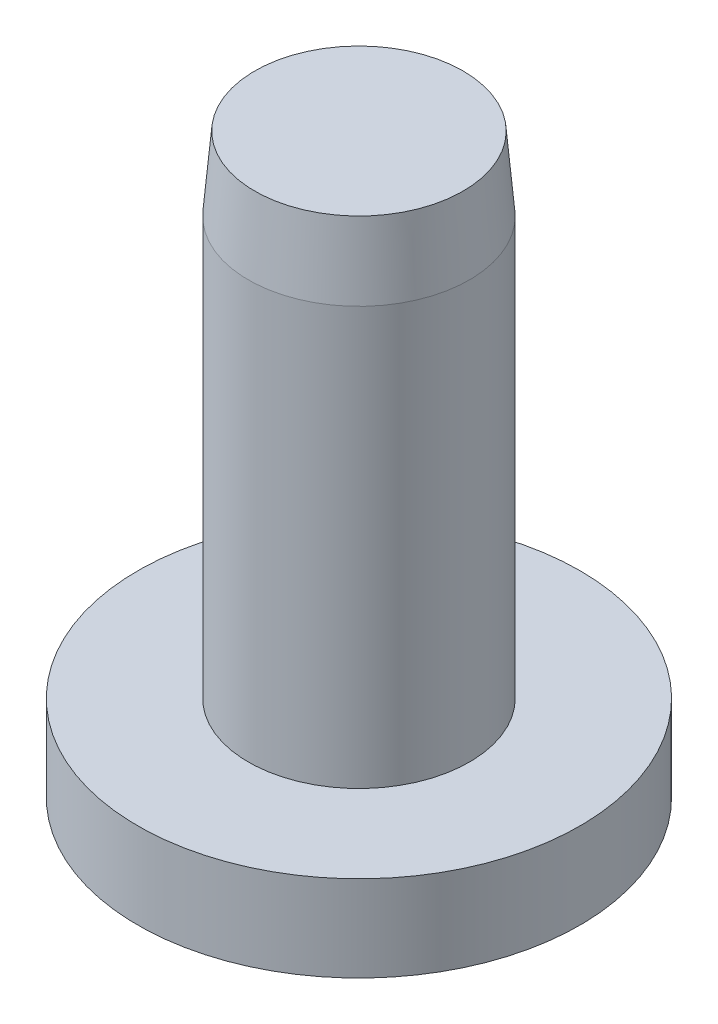
ISO-10303-21;
HEADER;
FILE_DESCRIPTION(('STEP AP214'),'2;1');
FILE_NAME('part.step','',(''),(''),'','','');
FILE_SCHEMA(('AUTOMOTIVE_DESIGN { 1 0 10303 214 1 1 1 1 }'));
ENDSEC;
DATA;
#1=APPLICATION_CONTEXT('core data for automotive mechanical design processes');
#2=APPLICATION_PROTOCOL_DEFINITION('international standard','automotive_design',2000,#1);
#3=PRODUCT_CONTEXT('',#1,'mechanical');
#4=PRODUCT('Part','Part','',(#3));
#5=PRODUCT_RELATED_PRODUCT_CATEGORY('part','',(#4));
#6=PRODUCT_DEFINITION_FORMATION('','',#4);
#7=PRODUCT_DEFINITION_CONTEXT('part definition',#1,'design');
#8=PRODUCT_DEFINITION('design','',#6,#7);
#9=PRODUCT_DEFINITION_SHAPE('','',#8);
#10=(LENGTH_UNIT() NAMED_UNIT(*) SI_UNIT(.MILLI.,.METRE.));
#11=(NAMED_UNIT(*) PLANE_ANGLE_UNIT() SI_UNIT($,.RADIAN.));
#12=(NAMED_UNIT(*) SI_UNIT($,.STERADIAN.) SOLID_ANGLE_UNIT());
#13=UNCERTAINTY_MEASURE_WITH_UNIT(LENGTH_MEASURE(1.E-05),#10,'distance_accuracy_value','');
#14=(GEOMETRIC_REPRESENTATION_CONTEXT(3) GLOBAL_UNCERTAINTY_ASSIGNED_CONTEXT((#13)) GLOBAL_UNIT_ASSIGNED_CONTEXT((#10,
#11,#12)) REPRESENTATION_CONTEXT('',''));
#15=CARTESIAN_POINT('',(0.,0.,0.));
#16=DIRECTION('',(0.,0.,1.));
#17=DIRECTION('',(1.,0.,0.));
#18=AXIS2_PLACEMENT_3D('',#15,#16,#17);
#19=CARTESIAN_POINT('',(-8.,0.,0.));
#20=DIRECTION('',(0.,1.,0.));
#21=DIRECTION('',(0.,0.,1.));
#22=AXIS2_PLACEMENT_3D('',#19,#20,#21);
#23=PLANE('',#22);
#24=CARTESIAN_POINT('',(0.,0.,0.));
#25=DIRECTION('',(0.,-1.,0.));
#26=DIRECTION('',(0.,0.,-1.));
#27=AXIS2_PLACEMENT_3D('',#24,#25,#26);
#28=CIRCLE('',#27,8.);
#29=CARTESIAN_POINT('',(0.,0.,-8.));
#30=VERTEX_POINT('',#29);
#31=EDGE_CURVE('E59',#30,#30,#28,.T.);
#32=ORIENTED_EDGE('',*,*,#31,.T.);
#33=EDGE_LOOP('',(#32));
#34=FACE_BOUND('',#33,.T.);
#35=ADVANCED_FACE('F32',(#34),#23,.F.);
#36=CARTESIAN_POINT('',(0.,21.5,0.));
#37=DIRECTION('',(0.,-1.,0.));
#38=DIRECTION('',(0.,0.,-1.));
#39=AXIS2_PLACEMENT_3D('',#36,#37,#38);
#40=PLANE('',#39);
#41=CARTESIAN_POINT('',(0.,21.5,0.));
#42=DIRECTION('',(0.,-1.,0.));
#43=DIRECTION('',(0.,0.,-1.));
#44=AXIS2_PLACEMENT_3D('',#41,#42,#43);
#45=CIRCLE('',#44,4.24000000000001);
#46=CARTESIAN_POINT('',(0.,21.5,-4.24000000000001));
#47=VERTEX_POINT('',#46);
#48=EDGE_CURVE('E10',#47,#47,#45,.F.);
#49=ORIENTED_EDGE('',*,*,#48,.T.);
#50=EDGE_LOOP('',(#49));
#51=FACE_BOUND('',#50,.T.);
#52=ADVANCED_FACE('F90',(#51),#40,.F.);
#53=CARTESIAN_POINT('',(0.,0.,0.));
#54=DIRECTION('',(0.,-1.,0.));
#55=DIRECTION('',(0.,0.,-1.));
#56=AXIS2_PLACEMENT_3D('',#53,#54,#55);
#57=CYLINDRICAL_SURFACE('',#56,4.5);
#58=CARTESIAN_POINT('',(0.,18.5,0.));
#59=DIRECTION('',(0.,-1.,0.));
#60=DIRECTION('',(0.,0.,-1.));
#61=AXIS2_PLACEMENT_3D('',#58,#59,#60);
#62=CIRCLE('',#61,4.5);
#63=CARTESIAN_POINT('',(0.,18.5,-4.5));
#64=VERTEX_POINT('',#63);
#65=EDGE_CURVE('E40',#64,#64,#62,.T.);
#66=ORIENTED_EDGE('',*,*,#65,.T.);
#67=EDGE_LOOP('',(#66));
#68=FACE_BOUND('',#67,.T.);
#69=CARTESIAN_POINT('',(0.,1.5,0.));
#70=DIRECTION('',(0.,-1.,0.));
#71=DIRECTION('',(0.,0.,-1.));
#72=AXIS2_PLACEMENT_3D('',#69,#70,#71);
#73=CIRCLE('',#72,4.5);
#74=CARTESIAN_POINT('',(0.,1.5,-4.5));
#75=VERTEX_POINT('',#74);
#76=EDGE_CURVE('E44',#75,#75,#73,.T.);
#77=ORIENTED_EDGE('',*,*,#76,.F.);
#78=EDGE_LOOP('',(#77));
#79=FACE_BOUND('',#78,.T.);
#80=ADVANCED_FACE('F85',(#68,#79),#57,.T.);
#81=CARTESIAN_POINT('',(-4.5,1.5,0.));
#82=DIRECTION('',(0.,-1.,0.));
#83=DIRECTION('',(0.,0.,-1.));
#84=AXIS2_PLACEMENT_3D('',#81,#82,#83);
#85=PLANE('',#84);
#86=CARTESIAN_POINT('',(0.,1.5,0.));
#87=DIRECTION('',(0.,-1.,0.));
#88=DIRECTION('',(0.,0.,-1.));
#89=AXIS2_PLACEMENT_3D('',#86,#87,#88);
#90=CIRCLE('',#89,9.);
#91=CARTESIAN_POINT('',(0.,1.5,-9.));
#92=VERTEX_POINT('',#91);
#93=EDGE_CURVE('E48',#92,#92,#90,.T.);
#94=ORIENTED_EDGE('',*,*,#93,.F.);
#95=EDGE_LOOP('',(#94));
#96=FACE_BOUND('',#95,.T.);
#97=ORIENTED_EDGE('',*,*,#76,.T.);
#98=EDGE_LOOP('',(#97));
#99=FACE_BOUND('',#98,.T.);
#100=ADVANCED_FACE('F79',(#96,#99),#85,.F.);
#101=CARTESIAN_POINT('',(0.,0.,0.));
#102=DIRECTION('',(0.,-1.,0.));
#103=DIRECTION('',(0.,0.,-1.));
#104=AXIS2_PLACEMENT_3D('',#101,#102,#103);
#105=CYLINDRICAL_SURFACE('',#104,9.);
#106=CARTESIAN_POINT('',(0.,-2.,0.));
#107=DIRECTION('',(0.,-1.,0.));
#108=DIRECTION('',(0.,0.,-1.));
#109=AXIS2_PLACEMENT_3D('',#106,#107,#108);
#110=CIRCLE('',#109,9.);
#111=CARTESIAN_POINT('',(0.,-2.,-9.));
#112=VERTEX_POINT('',#111);
#113=EDGE_CURVE('E53',#112,#112,#110,.T.);
#114=ORIENTED_EDGE('',*,*,#113,.F.);
#115=EDGE_LOOP('',(#114));
#116=FACE_BOUND('',#115,.T.);
#117=ORIENTED_EDGE('',*,*,#93,.T.);
#118=EDGE_LOOP('',(#117));
#119=FACE_BOUND('',#118,.T.);
#120=ADVANCED_FACE('F73',(#116,#119),#105,.T.);
#121=CARTESIAN_POINT('',(-9.,-2.,0.));
#122=DIRECTION('',(0.,1.,0.));
#123=DIRECTION('',(0.,0.,1.));
#124=AXIS2_PLACEMENT_3D('',#121,#122,#123);
#125=PLANE('',#124);
#126=CARTESIAN_POINT('',(0.,-2.,0.));
#127=DIRECTION('',(0.,-1.,0.));
#128=DIRECTION('',(0.,0.,-1.));
#129=AXIS2_PLACEMENT_3D('',#126,#127,#128);
#130=CIRCLE('',#129,8.);
#131=CARTESIAN_POINT('',(0.,-2.,-8.));
#132=VERTEX_POINT('',#131);
#133=EDGE_CURVE('E56',#132,#132,#130,.T.);
#134=ORIENTED_EDGE('',*,*,#133,.F.);
#135=EDGE_LOOP('',(#134));
#136=FACE_BOUND('',#135,.T.);
#137=ORIENTED_EDGE('',*,*,#113,.T.);
#138=EDGE_LOOP('',(#137));
#139=FACE_BOUND('',#138,.T.);
#140=ADVANCED_FACE('F67',(#136,#139),#125,.F.);
#141=CARTESIAN_POINT('',(0.,0.,0.));
#142=DIRECTION('',(0.,-1.,0.));
#143=DIRECTION('',(0.,0.,-1.));
#144=AXIS2_PLACEMENT_3D('',#141,#142,#143);
#145=CYLINDRICAL_SURFACE('',#144,8.);
#146=ORIENTED_EDGE('',*,*,#31,.F.);
#147=EDGE_LOOP('',(#146));
#148=FACE_BOUND('',#147,.T.);
#149=ORIENTED_EDGE('',*,*,#133,.T.);
#150=EDGE_LOOP('',(#149));
#151=FACE_BOUND('',#150,.T.);
#152=ADVANCED_FACE('F64',(#148,#151),#145,.F.);
#153=CARTESIAN_POINT('',(0.,18.5,0.));
#154=DIRECTION('',(0.,-1.,0.));
#155=DIRECTION('',(0.,0.,-1.));
#156=AXIS2_PLACEMENT_3D('',#153,#154,#155);
#157=CONICAL_SURFACE('',#156,4.5,0.0864506516873704);
#158=ORIENTED_EDGE('',*,*,#48,.F.);
#159=EDGE_LOOP('',(#158));
#160=FACE_BOUND('',#159,.T.);
#161=ORIENTED_EDGE('',*,*,#65,.F.);
#162=EDGE_LOOP('',(#161));
#163=FACE_BOUND('',#162,.T.);
#164=ADVANCED_FACE('F35',(#160,#163),#157,.T.);
#165=CLOSED_SHELL('',(#35,#52,#80,#100,#120,#140,#152,#164));
#166=MANIFOLD_SOLID_BREP('B2',#165);
#167=ADVANCED_BREP_SHAPE_REPRESENTATION('',(#18,#166),#14);
#168=SHAPE_DEFINITION_REPRESENTATION(#9,#167);
ENDSEC;
END-ISO-10303-21;
